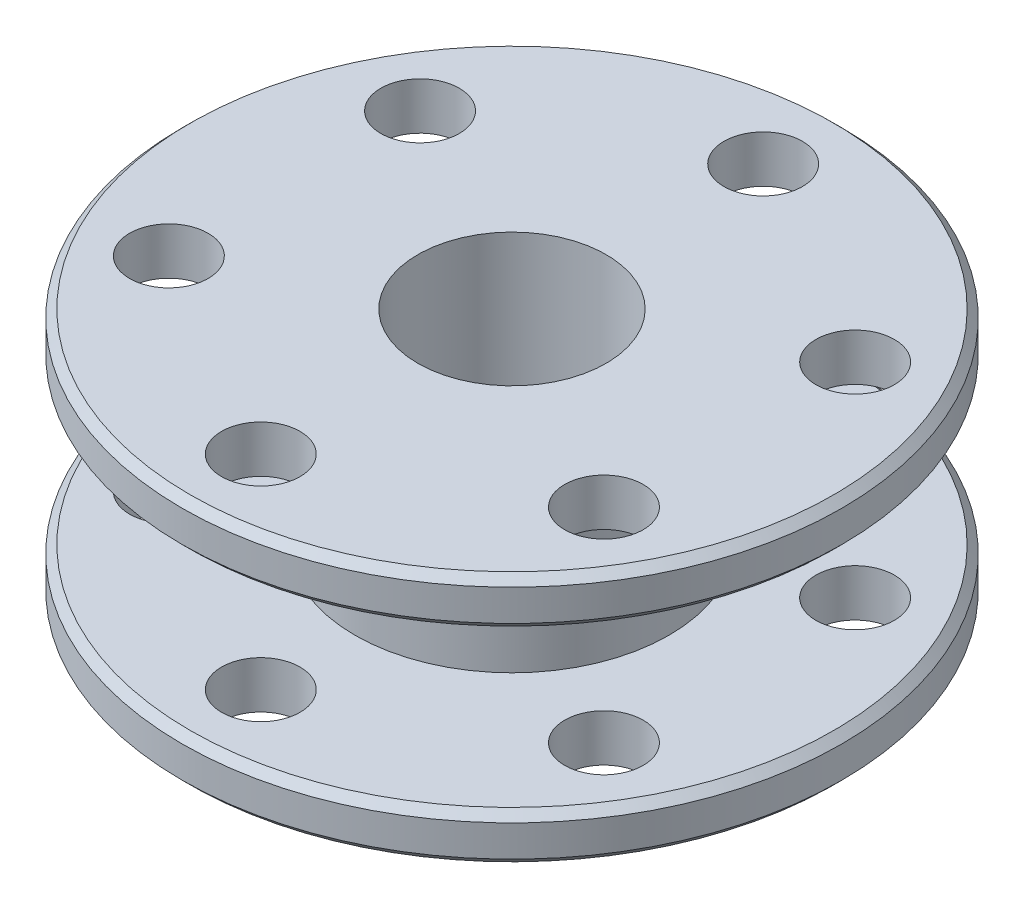
ISO-10303-21;
HEADER;
FILE_DESCRIPTION(('STEP AP214'),'2;1');
FILE_NAME('part.step','',(''),(''),'','','');
FILE_SCHEMA(('AUTOMOTIVE_DESIGN { 1 0 10303 214 1 1 1 1 }'));
ENDSEC;
DATA;
#1=APPLICATION_CONTEXT('core data for automotive mechanical design processes');
#2=APPLICATION_PROTOCOL_DEFINITION('international standard','automotive_design',2000,#1);
#3=PRODUCT_CONTEXT('',#1,'mechanical');
#4=PRODUCT('Part','Part','',(#3));
#5=PRODUCT_RELATED_PRODUCT_CATEGORY('part','',(#4));
#6=PRODUCT_DEFINITION_FORMATION('','',#4);
#7=PRODUCT_DEFINITION_CONTEXT('part definition',#1,'design');
#8=PRODUCT_DEFINITION('design','',#6,#7);
#9=PRODUCT_DEFINITION_SHAPE('','',#8);
#10=(LENGTH_UNIT() NAMED_UNIT(*) SI_UNIT(.MILLI.,.METRE.));
#11=(NAMED_UNIT(*) PLANE_ANGLE_UNIT() SI_UNIT($,.RADIAN.));
#12=(NAMED_UNIT(*) SI_UNIT($,.STERADIAN.) SOLID_ANGLE_UNIT());
#13=UNCERTAINTY_MEASURE_WITH_UNIT(LENGTH_MEASURE(1.E-05),#10,'distance_accuracy_value','');
#14=(GEOMETRIC_REPRESENTATION_CONTEXT(3) GLOBAL_UNCERTAINTY_ASSIGNED_CONTEXT((#13)) GLOBAL_UNIT_ASSIGNED_CONTEXT((#10,
#11,#12)) REPRESENTATION_CONTEXT('',''));
#15=CARTESIAN_POINT('',(0.,0.,0.));
#16=DIRECTION('',(0.,0.,1.));
#17=DIRECTION('',(1.,0.,0.));
#18=AXIS2_PLACEMENT_3D('',#15,#16,#17);
#19=CARTESIAN_POINT('',(-6.,-8.,0.));
#20=DIRECTION('',(0.,-1.,0.));
#21=DIRECTION('',(0.,0.,-1.));
#22=AXIS2_PLACEMENT_3D('',#19,#20,#21);
#23=PLANE('',#22);
#24=CARTESIAN_POINT('',(0.,-8.,16.));
#25=DIRECTION('',(0.,-1.,0.));
#26=DIRECTION('',(0.,0.,-1.));
#27=AXIS2_PLACEMENT_3D('',#24,#25,#26);
#28=CIRCLE('',#27,2.5);
#29=CARTESIAN_POINT('',(0.,-8.,13.5));
#30=VERTEX_POINT('',#29);
#31=EDGE_CURVE('E180',#30,#30,#28,.T.);
#32=ORIENTED_EDGE('',*,*,#31,.F.);
#33=EDGE_LOOP('',(#32));
#34=FACE_BOUND('',#33,.T.);
#35=CARTESIAN_POINT('',(-13.8564064605509,-8.,8.00000000000016));
#36=DIRECTION('',(0.,-1.,0.));
#37=DIRECTION('',(0.,0.,-1.));
#38=AXIS2_PLACEMENT_3D('',#35,#36,#37);
#39=CIRCLE('',#38,2.5);
#40=CARTESIAN_POINT('',(-13.8564064605509,-8.,5.50000000000016));
#41=VERTEX_POINT('',#40);
#42=EDGE_CURVE('E181',#41,#41,#39,.T.);
#43=ORIENTED_EDGE('',*,*,#42,.F.);
#44=EDGE_LOOP('',(#43));
#45=FACE_BOUND('',#44,.T.);
#46=CARTESIAN_POINT('',(-13.8564064605511,-8.,-7.99999999999987));
#47=DIRECTION('',(0.,-1.,0.));
#48=DIRECTION('',(0.,0.,-1.));
#49=AXIS2_PLACEMENT_3D('',#46,#47,#48);
#50=CIRCLE('',#49,2.5);
#51=CARTESIAN_POINT('',(-13.8564064605511,-8.,-10.4999999999999));
#52=VERTEX_POINT('',#51);
#53=EDGE_CURVE('E147',#52,#52,#50,.T.);
#54=ORIENTED_EDGE('',*,*,#53,.F.);
#55=EDGE_LOOP('',(#54));
#56=FACE_BOUND('',#55,.T.);
#57=CARTESIAN_POINT('',(-1.1172740284298E-13,-8.,-16.));
#58=DIRECTION('',(0.,-1.,0.));
#59=DIRECTION('',(0.,0.,-1.));
#60=AXIS2_PLACEMENT_3D('',#57,#58,#59);
#61=CIRCLE('',#60,2.5);
#62=CARTESIAN_POINT('',(-1.1172740284298E-13,-8.,-18.5));
#63=VERTEX_POINT('',#62);
#64=EDGE_CURVE('E156',#63,#63,#61,.T.);
#65=ORIENTED_EDGE('',*,*,#64,.F.);
#66=EDGE_LOOP('',(#65));
#67=FACE_BOUND('',#66,.T.);
#68=CARTESIAN_POINT('',(13.856406460551,-8.,-8.00000000000007));
#69=DIRECTION('',(0.,-1.,0.));
#70=DIRECTION('',(0.,0.,-1.));
#71=AXIS2_PLACEMENT_3D('',#68,#69,#70);
#72=CIRCLE('',#71,2.5);
#73=CARTESIAN_POINT('',(13.856406460551,-8.,-10.5000000000001));
#74=VERTEX_POINT('',#73);
#75=EDGE_CURVE('E164',#74,#74,#72,.T.);
#76=ORIENTED_EDGE('',*,*,#75,.F.);
#77=EDGE_LOOP('',(#76));
#78=FACE_BOUND('',#77,.T.);
#79=CARTESIAN_POINT('',(13.856406460551,-8.,7.99999999999997));
#80=DIRECTION('',(0.,-1.,0.));
#81=DIRECTION('',(0.,0.,-1.));
#82=AXIS2_PLACEMENT_3D('',#79,#80,#81);
#83=CIRCLE('',#82,2.5);
#84=CARTESIAN_POINT('',(13.856406460551,-8.,5.49999999999997));
#85=VERTEX_POINT('',#84);
#86=EDGE_CURVE('E172',#85,#85,#83,.T.);
#87=ORIENTED_EDGE('',*,*,#86,.F.);
#88=EDGE_LOOP('',(#87));
#89=FACE_BOUND('',#88,.T.);
#90=CARTESIAN_POINT('',(0.,-8.,0.));
#91=DIRECTION('',(0.,-1.,0.));
#92=DIRECTION('',(0.,0.,-1.));
#93=AXIS2_PLACEMENT_3D('',#90,#91,#92);
#94=CIRCLE('',#93,20.5);
#95=CARTESIAN_POINT('',(0.,-8.,-20.5));
#96=VERTEX_POINT('',#95);
#97=EDGE_CURVE('E70',#96,#96,#94,.T.);
#98=ORIENTED_EDGE('',*,*,#97,.T.);
#99=EDGE_LOOP('',(#98));
#100=FACE_BOUND('',#99,.T.);
#101=CARTESIAN_POINT('',(0.,-8.,0.));
#102=DIRECTION('',(0.,1.,0.));
#103=DIRECTION('',(0.,0.,1.));
#104=AXIS2_PLACEMENT_3D('',#101,#102,#103);
#105=CIRCLE('',#104,6.);
#106=CARTESIAN_POINT('',(0.,-8.,6.));
#107=VERTEX_POINT('',#106);
#108=EDGE_CURVE('E94',#107,#107,#105,.T.);
#109=ORIENTED_EDGE('',*,*,#108,.T.);
#110=EDGE_LOOP('',(#109));
#111=FACE_BOUND('',#110,.T.);
#112=ADVANCED_FACE('F41',(#34,#45,#56,#67,#78,#89,#100,#111),#23,.T.);
#113=CARTESIAN_POINT('',(0.,39.6851391119242,0.));
#114=DIRECTION('',(0.,1.,0.));
#115=DIRECTION('',(0.,0.,1.));
#116=AXIS2_PLACEMENT_3D('',#113,#114,#115);
#117=CYLINDRICAL_SURFACE('',#116,21.);
#118=CARTESIAN_POINT('',(0.,-7.50000000000001,0.));
#119=DIRECTION('',(0.,-1.,0.));
#120=DIRECTION('',(0.,0.,-1.));
#121=AXIS2_PLACEMENT_3D('',#118,#119,#120);
#122=CIRCLE('',#121,21.);
#123=CARTESIAN_POINT('',(0.,-7.50000000000001,-21.));
#124=VERTEX_POINT('',#123);
#125=EDGE_CURVE('E74',#124,#124,#122,.F.);
#126=ORIENTED_EDGE('',*,*,#125,.T.);
#127=EDGE_LOOP('',(#126));
#128=FACE_BOUND('',#127,.T.);
#129=CARTESIAN_POINT('',(0.,-5.50000000000001,0.));
#130=DIRECTION('',(0.,1.,0.));
#131=DIRECTION('',(0.,0.,1.));
#132=AXIS2_PLACEMENT_3D('',#129,#130,#131);
#133=CIRCLE('',#132,21.);
#134=CARTESIAN_POINT('',(0.,-5.50000000000001,21.));
#135=VERTEX_POINT('',#134);
#136=EDGE_CURVE('E78',#135,#135,#133,.F.);
#137=ORIENTED_EDGE('',*,*,#136,.T.);
#138=EDGE_LOOP('',(#137));
#139=FACE_BOUND('',#138,.T.);
#140=ADVANCED_FACE('F220',(#128,#139),#117,.T.);
#141=CARTESIAN_POINT('',(-21.,-5.00000000000001,0.));
#142=DIRECTION('',(0.,1.,0.));
#143=DIRECTION('',(0.,0.,1.));
#144=AXIS2_PLACEMENT_3D('',#141,#142,#143);
#145=PLANE('',#144);
#146=CARTESIAN_POINT('',(0.,-5.00000000000001,16.));
#147=DIRECTION('',(0.,1.,0.));
#148=DIRECTION('',(0.,0.,1.));
#149=AXIS2_PLACEMENT_3D('',#146,#147,#148);
#150=CIRCLE('',#149,2.5);
#151=CARTESIAN_POINT('',(0.,-5.00000000000001,18.5));
#152=VERTEX_POINT('',#151);
#153=EDGE_CURVE('E98',#152,#152,#150,.T.);
#154=ORIENTED_EDGE('',*,*,#153,.F.);
#155=EDGE_LOOP('',(#154));
#156=FACE_BOUND('',#155,.T.);
#157=CARTESIAN_POINT('',(-13.8564064605509,-5.00000000000001,8.00000000000016));
#158=DIRECTION('',(0.,1.,0.));
#159=DIRECTION('',(0.,0.,1.));
#160=AXIS2_PLACEMENT_3D('',#157,#158,#159);
#161=CIRCLE('',#160,2.5);
#162=CARTESIAN_POINT('',(-13.8564064605509,-5.00000000000001,10.5000000000002));
#163=VERTEX_POINT('',#162);
#164=EDGE_CURVE('E106',#163,#163,#161,.T.);
#165=ORIENTED_EDGE('',*,*,#164,.F.);
#166=EDGE_LOOP('',(#165));
#167=FACE_BOUND('',#166,.T.);
#168=CARTESIAN_POINT('',(-13.8564064605511,-5.00000000000001,-7.99999999999987));
#169=DIRECTION('',(0.,1.,0.));
#170=DIRECTION('',(0.,0.,1.));
#171=AXIS2_PLACEMENT_3D('',#168,#169,#170);
#172=CIRCLE('',#171,2.5);
#173=CARTESIAN_POINT('',(-13.8564064605511,-5.00000000000001,-5.49999999999987));
#174=VERTEX_POINT('',#173);
#175=EDGE_CURVE('E114',#174,#174,#172,.T.);
#176=ORIENTED_EDGE('',*,*,#175,.F.);
#177=EDGE_LOOP('',(#176));
#178=FACE_BOUND('',#177,.T.);
#179=CARTESIAN_POINT('',(-1.1172740284298E-13,-5.00000000000001,-16.));
#180=DIRECTION('',(0.,1.,0.));
#181=DIRECTION('',(0.,0.,1.));
#182=AXIS2_PLACEMENT_3D('',#179,#180,#181);
#183=CIRCLE('',#182,2.5);
#184=CARTESIAN_POINT('',(-1.1172740284298E-13,-5.00000000000001,-13.5));
#185=VERTEX_POINT('',#184);
#186=EDGE_CURVE('E122',#185,#185,#183,.T.);
#187=ORIENTED_EDGE('',*,*,#186,.F.);
#188=EDGE_LOOP('',(#187));
#189=FACE_BOUND('',#188,.T.);
#190=CARTESIAN_POINT('',(13.856406460551,-5.00000000000001,-8.00000000000007));
#191=DIRECTION('',(0.,1.,0.));
#192=DIRECTION('',(0.,0.,1.));
#193=AXIS2_PLACEMENT_3D('',#190,#191,#192);
#194=CIRCLE('',#193,2.5);
#195=CARTESIAN_POINT('',(13.856406460551,-5.00000000000001,-5.50000000000006));
#196=VERTEX_POINT('',#195);
#197=EDGE_CURVE('E130',#196,#196,#194,.T.);
#198=ORIENTED_EDGE('',*,*,#197,.F.);
#199=EDGE_LOOP('',(#198));
#200=FACE_BOUND('',#199,.T.);
#201=CARTESIAN_POINT('',(13.856406460551,-5.00000000000001,7.99999999999997));
#202=DIRECTION('',(0.,1.,0.));
#203=DIRECTION('',(0.,0.,1.));
#204=AXIS2_PLACEMENT_3D('',#201,#202,#203);
#205=CIRCLE('',#204,2.5);
#206=CARTESIAN_POINT('',(13.856406460551,-5.00000000000001,10.5));
#207=VERTEX_POINT('',#206);
#208=EDGE_CURVE('E138',#207,#207,#205,.T.);
#209=ORIENTED_EDGE('',*,*,#208,.F.);
#210=EDGE_LOOP('',(#209));
#211=FACE_BOUND('',#210,.T.);
#212=CARTESIAN_POINT('',(0.,-5.00000000000001,0.));
#213=DIRECTION('',(0.,1.,0.));
#214=DIRECTION('',(0.,0.,1.));
#215=AXIS2_PLACEMENT_3D('',#212,#213,#214);
#216=CIRCLE('',#215,20.5);
#217=CARTESIAN_POINT('',(0.,-5.00000000000001,20.5));
#218=VERTEX_POINT('',#217);
#219=EDGE_CURVE('E66',#218,#218,#216,.T.);
#220=ORIENTED_EDGE('',*,*,#219,.T.);
#221=EDGE_LOOP('',(#220));
#222=FACE_BOUND('',#221,.T.);
#223=CARTESIAN_POINT('',(0.,-5.00000000000001,0.));
#224=DIRECTION('',(0.,1.,0.));
#225=DIRECTION('',(0.,0.,1.));
#226=AXIS2_PLACEMENT_3D('',#223,#224,#225);
#227=CIRCLE('',#226,10.);
#228=CARTESIAN_POINT('',(0.,-5.00000000000001,10.));
#229=VERTEX_POINT('',#228);
#230=EDGE_CURVE('E82',#229,#229,#227,.T.);
#231=ORIENTED_EDGE('',*,*,#230,.F.);
#232=EDGE_LOOP('',(#231));
#233=FACE_BOUND('',#232,.T.);
#234=ADVANCED_FACE('F226',(#156,#167,#178,#189,#200,#211,#222,#233),#145,.T.);
#235=CARTESIAN_POINT('',(0.,39.6851391119242,0.));
#236=DIRECTION('',(0.,1.,0.));
#237=DIRECTION('',(0.,0.,1.));
#238=AXIS2_PLACEMENT_3D('',#235,#236,#237);
#239=CYLINDRICAL_SURFACE('',#238,10.);
#240=ORIENTED_EDGE('',*,*,#230,.T.);
#241=EDGE_LOOP('',(#240));
#242=FACE_BOUND('',#241,.T.);
#243=CARTESIAN_POINT('',(0.,5.00000000000001,0.));
#244=DIRECTION('',(0.,1.,0.));
#245=DIRECTION('',(0.,0.,1.));
#246=AXIS2_PLACEMENT_3D('',#243,#244,#245);
#247=CIRCLE('',#246,10.);
#248=CARTESIAN_POINT('',(0.,5.00000000000001,10.));
#249=VERTEX_POINT('',#248);
#250=EDGE_CURVE('E86',#249,#249,#247,.T.);
#251=ORIENTED_EDGE('',*,*,#250,.F.);
#252=EDGE_LOOP('',(#251));
#253=FACE_BOUND('',#252,.T.);
#254=ADVANCED_FACE('F272',(#242,#253),#239,.T.);
#255=CARTESIAN_POINT('',(-10.,5.00000000000001,0.));
#256=DIRECTION('',(0.,-1.,0.));
#257=DIRECTION('',(0.,0.,-1.));
#258=AXIS2_PLACEMENT_3D('',#255,#256,#257);
#259=PLANE('',#258);
#260=CARTESIAN_POINT('',(0.,5.00000000000001,16.));
#261=DIRECTION('',(0.,-1.,0.));
#262=DIRECTION('',(0.,0.,-1.));
#263=AXIS2_PLACEMENT_3D('',#260,#261,#262);
#264=CIRCLE('',#263,2.5);
#265=CARTESIAN_POINT('',(0.,5.00000000000001,13.5));
#266=VERTEX_POINT('',#265);
#267=EDGE_CURVE('E102',#266,#266,#264,.T.);
#268=ORIENTED_EDGE('',*,*,#267,.F.);
#269=EDGE_LOOP('',(#268));
#270=FACE_BOUND('',#269,.T.);
#271=CARTESIAN_POINT('',(-13.8564064605509,5.00000000000001,8.00000000000016));
#272=DIRECTION('',(0.,-1.,0.));
#273=DIRECTION('',(0.,0.,-1.));
#274=AXIS2_PLACEMENT_3D('',#271,#272,#273);
#275=CIRCLE('',#274,2.5);
#276=CARTESIAN_POINT('',(-13.8564064605509,5.00000000000001,5.50000000000016));
#277=VERTEX_POINT('',#276);
#278=EDGE_CURVE('E110',#277,#277,#275,.T.);
#279=ORIENTED_EDGE('',*,*,#278,.F.);
#280=EDGE_LOOP('',(#279));
#281=FACE_BOUND('',#280,.T.);
#282=CARTESIAN_POINT('',(-13.8564064605511,5.00000000000001,-7.99999999999987));
#283=DIRECTION('',(0.,-1.,0.));
#284=DIRECTION('',(0.,0.,-1.));
#285=AXIS2_PLACEMENT_3D('',#282,#283,#284);
#286=CIRCLE('',#285,2.5);
#287=CARTESIAN_POINT('',(-13.8564064605511,5.00000000000001,-10.4999999999999));
#288=VERTEX_POINT('',#287);
#289=EDGE_CURVE('E118',#288,#288,#286,.T.);
#290=ORIENTED_EDGE('',*,*,#289,.F.);
#291=EDGE_LOOP('',(#290));
#292=FACE_BOUND('',#291,.T.);
#293=CARTESIAN_POINT('',(-1.1172740284298E-13,5.00000000000001,-16.));
#294=DIRECTION('',(0.,-1.,0.));
#295=DIRECTION('',(0.,0.,-1.));
#296=AXIS2_PLACEMENT_3D('',#293,#294,#295);
#297=CIRCLE('',#296,2.5);
#298=CARTESIAN_POINT('',(-1.1172740284298E-13,5.00000000000001,-18.5));
#299=VERTEX_POINT('',#298);
#300=EDGE_CURVE('E126',#299,#299,#297,.T.);
#301=ORIENTED_EDGE('',*,*,#300,.F.);
#302=EDGE_LOOP('',(#301));
#303=FACE_BOUND('',#302,.T.);
#304=CARTESIAN_POINT('',(13.856406460551,5.00000000000001,-8.00000000000007));
#305=DIRECTION('',(0.,-1.,0.));
#306=DIRECTION('',(0.,0.,-1.));
#307=AXIS2_PLACEMENT_3D('',#304,#305,#306);
#308=CIRCLE('',#307,2.5);
#309=CARTESIAN_POINT('',(13.856406460551,5.00000000000001,-10.5000000000001));
#310=VERTEX_POINT('',#309);
#311=EDGE_CURVE('E134',#310,#310,#308,.T.);
#312=ORIENTED_EDGE('',*,*,#311,.F.);
#313=EDGE_LOOP('',(#312));
#314=FACE_BOUND('',#313,.T.);
#315=CARTESIAN_POINT('',(13.856406460551,5.00000000000001,7.99999999999997));
#316=DIRECTION('',(0.,-1.,0.));
#317=DIRECTION('',(0.,0.,-1.));
#318=AXIS2_PLACEMENT_3D('',#315,#316,#317);
#319=CIRCLE('',#318,2.5);
#320=CARTESIAN_POINT('',(13.856406460551,5.00000000000001,5.49999999999997));
#321=VERTEX_POINT('',#320);
#322=EDGE_CURVE('E142',#321,#321,#319,.T.);
#323=ORIENTED_EDGE('',*,*,#322,.F.);
#324=EDGE_LOOP('',(#323));
#325=FACE_BOUND('',#324,.T.);
#326=CARTESIAN_POINT('',(0.,5.00000000000001,0.));
#327=DIRECTION('',(0.,-1.,0.));
#328=DIRECTION('',(0.,0.,-1.));
#329=AXIS2_PLACEMENT_3D('',#326,#327,#328);
#330=CIRCLE('',#329,20.5);
#331=CARTESIAN_POINT('',(0.,5.00000000000001,-20.5));
#332=VERTEX_POINT('',#331);
#333=EDGE_CURVE('E50',#332,#332,#330,.T.);
#334=ORIENTED_EDGE('',*,*,#333,.T.);
#335=EDGE_LOOP('',(#334));
#336=FACE_BOUND('',#335,.T.);
#337=ORIENTED_EDGE('',*,*,#250,.T.);
#338=EDGE_LOOP('',(#337));
#339=FACE_BOUND('',#338,.T.);
#340=ADVANCED_FACE('F263',(#270,#281,#292,#303,#314,#325,#336,#339),#259,.T.);
#341=CARTESIAN_POINT('',(0.,39.6851391119242,0.));
#342=DIRECTION('',(0.,1.,0.));
#343=DIRECTION('',(0.,0.,1.));
#344=AXIS2_PLACEMENT_3D('',#341,#342,#343);
#345=CYLINDRICAL_SURFACE('',#344,21.);
#346=CARTESIAN_POINT('',(0.,5.50000000000001,0.));
#347=DIRECTION('',(0.,-1.,0.));
#348=DIRECTION('',(0.,0.,-1.));
#349=AXIS2_PLACEMENT_3D('',#346,#347,#348);
#350=CIRCLE('',#349,21.);
#351=CARTESIAN_POINT('',(0.,5.50000000000001,-21.));
#352=VERTEX_POINT('',#351);
#353=EDGE_CURVE('E55',#352,#352,#350,.F.);
#354=ORIENTED_EDGE('',*,*,#353,.T.);
#355=EDGE_LOOP('',(#354));
#356=FACE_BOUND('',#355,.T.);
#357=CARTESIAN_POINT('',(0.,7.50000000000001,0.));
#358=DIRECTION('',(0.,1.,0.));
#359=DIRECTION('',(0.,0.,1.));
#360=AXIS2_PLACEMENT_3D('',#357,#358,#359);
#361=CIRCLE('',#360,21.);
#362=CARTESIAN_POINT('',(0.,7.50000000000001,21.));
#363=VERTEX_POINT('',#362);
#364=EDGE_CURVE('E60',#363,#363,#361,.F.);
#365=ORIENTED_EDGE('',*,*,#364,.T.);
#366=EDGE_LOOP('',(#365));
#367=FACE_BOUND('',#366,.T.);
#368=ADVANCED_FACE('F260',(#356,#367),#345,.T.);
#369=CARTESIAN_POINT('',(-21.,8.,0.));
#370=DIRECTION('',(0.,1.,0.));
#371=DIRECTION('',(0.,0.,1.));
#372=AXIS2_PLACEMENT_3D('',#369,#370,#371);
#373=PLANE('',#372);
#374=CARTESIAN_POINT('',(0.,8.,16.));
#375=DIRECTION('',(0.,-1.,0.));
#376=DIRECTION('',(0.,0.,-1.));
#377=AXIS2_PLACEMENT_3D('',#374,#375,#376);
#378=CIRCLE('',#377,2.5);
#379=CARTESIAN_POINT('',(0.,8.,13.5));
#380=VERTEX_POINT('',#379);
#381=EDGE_CURVE('E146',#380,#380,#378,.T.);
#382=ORIENTED_EDGE('',*,*,#381,.T.);
#383=EDGE_LOOP('',(#382));
#384=FACE_BOUND('',#383,.T.);
#385=CARTESIAN_POINT('',(-13.8564064605509,8.,8.00000000000016));
#386=DIRECTION('',(0.,-1.,0.));
#387=DIRECTION('',(0.,0.,-1.));
#388=AXIS2_PLACEMENT_3D('',#385,#386,#387);
#389=CIRCLE('',#388,2.5);
#390=CARTESIAN_POINT('',(-13.8564064605509,8.,5.50000000000016));
#391=VERTEX_POINT('',#390);
#392=EDGE_CURVE('E152',#391,#391,#389,.T.);
#393=ORIENTED_EDGE('',*,*,#392,.T.);
#394=EDGE_LOOP('',(#393));
#395=FACE_BOUND('',#394,.T.);
#396=CARTESIAN_POINT('',(-13.8564064605511,8.,-7.99999999999987));
#397=DIRECTION('',(0.,-1.,0.));
#398=DIRECTION('',(0.,0.,-1.));
#399=AXIS2_PLACEMENT_3D('',#396,#397,#398);
#400=CIRCLE('',#399,2.5);
#401=CARTESIAN_POINT('',(-13.8564064605511,8.,-10.4999999999999));
#402=VERTEX_POINT('',#401);
#403=EDGE_CURVE('E151',#402,#402,#400,.T.);
#404=ORIENTED_EDGE('',*,*,#403,.T.);
#405=EDGE_LOOP('',(#404));
#406=FACE_BOUND('',#405,.T.);
#407=CARTESIAN_POINT('',(-1.1172740284298E-13,8.,-16.));
#408=DIRECTION('',(0.,-1.,0.));
#409=DIRECTION('',(0.,0.,-1.));
#410=AXIS2_PLACEMENT_3D('',#407,#408,#409);
#411=CIRCLE('',#410,2.5);
#412=CARTESIAN_POINT('',(-1.1172740284298E-13,8.,-18.5));
#413=VERTEX_POINT('',#412);
#414=EDGE_CURVE('E160',#413,#413,#411,.T.);
#415=ORIENTED_EDGE('',*,*,#414,.T.);
#416=EDGE_LOOP('',(#415));
#417=FACE_BOUND('',#416,.T.);
#418=CARTESIAN_POINT('',(13.856406460551,8.,-8.00000000000007));
#419=DIRECTION('',(0.,-1.,0.));
#420=DIRECTION('',(0.,0.,-1.));
#421=AXIS2_PLACEMENT_3D('',#418,#419,#420);
#422=CIRCLE('',#421,2.5);
#423=CARTESIAN_POINT('',(13.856406460551,8.,-10.5000000000001));
#424=VERTEX_POINT('',#423);
#425=EDGE_CURVE('E168',#424,#424,#422,.T.);
#426=ORIENTED_EDGE('',*,*,#425,.T.);
#427=EDGE_LOOP('',(#426));
#428=FACE_BOUND('',#427,.T.);
#429=CARTESIAN_POINT('',(13.856406460551,8.,7.99999999999997));
#430=DIRECTION('',(0.,-1.,0.));
#431=DIRECTION('',(0.,0.,-1.));
#432=AXIS2_PLACEMENT_3D('',#429,#430,#431);
#433=CIRCLE('',#432,2.5);
#434=CARTESIAN_POINT('',(13.856406460551,8.,5.49999999999997));
#435=VERTEX_POINT('',#434);
#436=EDGE_CURVE('E176',#435,#435,#433,.T.);
#437=ORIENTED_EDGE('',*,*,#436,.T.);
#438=EDGE_LOOP('',(#437));
#439=FACE_BOUND('',#438,.T.);
#440=CARTESIAN_POINT('',(0.,8.,0.));
#441=DIRECTION('',(0.,1.,0.));
#442=DIRECTION('',(0.,0.,1.));
#443=AXIS2_PLACEMENT_3D('',#440,#441,#442);
#444=CIRCLE('',#443,20.5);
#445=CARTESIAN_POINT('',(0.,8.,20.5));
#446=VERTEX_POINT('',#445);
#447=EDGE_CURVE('E10',#446,#446,#444,.T.);
#448=ORIENTED_EDGE('',*,*,#447,.T.);
#449=EDGE_LOOP('',(#448));
#450=FACE_BOUND('',#449,.T.);
#451=CARTESIAN_POINT('',(0.,8.,0.));
#452=DIRECTION('',(0.,1.,0.));
#453=DIRECTION('',(0.,0.,1.));
#454=AXIS2_PLACEMENT_3D('',#451,#452,#453);
#455=CIRCLE('',#454,6.00000000000001);
#456=CARTESIAN_POINT('',(0.,8.,6.00000000000001));
#457=VERTEX_POINT('',#456);
#458=EDGE_CURVE('E90',#457,#457,#455,.T.);
#459=ORIENTED_EDGE('',*,*,#458,.F.);
#460=EDGE_LOOP('',(#459));
#461=FACE_BOUND('',#460,.T.);
#462=ADVANCED_FACE('F195',(#384,#395,#406,#417,#428,#439,#450,#461),#373,.T.);
#463=CARTESIAN_POINT('',(0.,39.6851391119242,0.));
#464=DIRECTION('',(0.,1.,0.));
#465=DIRECTION('',(0.,0.,1.));
#466=AXIS2_PLACEMENT_3D('',#463,#464,#465);
#467=CYLINDRICAL_SURFACE('',#466,6.);
#468=ORIENTED_EDGE('',*,*,#458,.T.);
#469=EDGE_LOOP('',(#468));
#470=FACE_BOUND('',#469,.T.);
#471=ORIENTED_EDGE('',*,*,#108,.F.);
#472=EDGE_LOOP('',(#471));
#473=FACE_BOUND('',#472,.T.);
#474=ADVANCED_FACE('F241',(#470,#473),#467,.F.);
#475=CARTESIAN_POINT('',(0.,-7.50000000000001,0.));
#476=DIRECTION('',(0.,1.,0.));
#477=DIRECTION('',(0.,0.,1.));
#478=AXIS2_PLACEMENT_3D('',#475,#476,#477);
#479=CONICAL_SURFACE('',#478,21.,0.785398163397445);
#480=ORIENTED_EDGE('',*,*,#97,.F.);
#481=EDGE_LOOP('',(#480));
#482=FACE_BOUND('',#481,.T.);
#483=ORIENTED_EDGE('',*,*,#125,.F.);
#484=EDGE_LOOP('',(#483));
#485=FACE_BOUND('',#484,.T.);
#486=ADVANCED_FACE('F234',(#482,#485),#479,.T.);
#487=CARTESIAN_POINT('',(0.,-5.00000000000001,0.));
#488=DIRECTION('',(0.,-1.,0.));
#489=DIRECTION('',(0.,0.,-1.));
#490=AXIS2_PLACEMENT_3D('',#487,#488,#489);
#491=CONICAL_SURFACE('',#490,20.5,0.785398163397448);
#492=ORIENTED_EDGE('',*,*,#136,.F.);
#493=EDGE_LOOP('',(#492));
#494=FACE_BOUND('',#493,.T.);
#495=ORIENTED_EDGE('',*,*,#219,.F.);
#496=EDGE_LOOP('',(#495));
#497=FACE_BOUND('',#496,.T.);
#498=ADVANCED_FACE('F240',(#494,#497),#491,.T.);
#499=CARTESIAN_POINT('',(0.,5.50000000000001,0.));
#500=DIRECTION('',(0.,1.,0.));
#501=DIRECTION('',(0.,0.,1.));
#502=AXIS2_PLACEMENT_3D('',#499,#500,#501);
#503=CONICAL_SURFACE('',#502,21.,0.785398163397452);
#504=ORIENTED_EDGE('',*,*,#333,.F.);
#505=EDGE_LOOP('',(#504));
#506=FACE_BOUND('',#505,.T.);
#507=ORIENTED_EDGE('',*,*,#353,.F.);
#508=EDGE_LOOP('',(#507));
#509=FACE_BOUND('',#508,.T.);
#510=ADVANCED_FACE('F247',(#506,#509),#503,.T.);
#511=CARTESIAN_POINT('',(0.,8.,0.));
#512=DIRECTION('',(0.,-1.,0.));
#513=DIRECTION('',(0.,0.,-1.));
#514=AXIS2_PLACEMENT_3D('',#511,#512,#513);
#515=CONICAL_SURFACE('',#514,20.5,0.785398163397441);
#516=ORIENTED_EDGE('',*,*,#364,.F.);
#517=EDGE_LOOP('',(#516));
#518=FACE_BOUND('',#517,.T.);
#519=ORIENTED_EDGE('',*,*,#447,.F.);
#520=EDGE_LOOP('',(#519));
#521=FACE_BOUND('',#520,.T.);
#522=ADVANCED_FACE('F44',(#518,#521),#515,.T.);
#523=CARTESIAN_POINT('',(13.856406460551,8.,7.99999999999997));
#524=DIRECTION('',(0.,-1.,0.));
#525=DIRECTION('',(0.,0.,-1.));
#526=AXIS2_PLACEMENT_3D('',#523,#524,#525);
#527=CYLINDRICAL_SURFACE('',#526,2.5);
#528=ORIENTED_EDGE('',*,*,#322,.T.);
#529=EDGE_LOOP('',(#528));
#530=FACE_BOUND('',#529,.T.);
#531=ORIENTED_EDGE('',*,*,#436,.F.);
#532=EDGE_LOOP('',(#531));
#533=FACE_BOUND('',#532,.T.);
#534=ADVANCED_FACE('F212',(#530,#533),#527,.F.);
#535=CARTESIAN_POINT('',(13.856406460551,8.,-8.00000000000007));
#536=DIRECTION('',(0.,-1.,0.));
#537=DIRECTION('',(0.,0.,-1.));
#538=AXIS2_PLACEMENT_3D('',#535,#536,#537);
#539=CYLINDRICAL_SURFACE('',#538,2.5);
#540=ORIENTED_EDGE('',*,*,#311,.T.);
#541=EDGE_LOOP('',(#540));
#542=FACE_BOUND('',#541,.T.);
#543=ORIENTED_EDGE('',*,*,#425,.F.);
#544=EDGE_LOOP('',(#543));
#545=FACE_BOUND('',#544,.T.);
#546=ADVANCED_FACE('F322',(#542,#545),#539,.F.);
#547=CARTESIAN_POINT('',(-1.1172740284298E-13,8.,-16.));
#548=DIRECTION('',(0.,-1.,0.));
#549=DIRECTION('',(0.,0.,-1.));
#550=AXIS2_PLACEMENT_3D('',#547,#548,#549);
#551=CYLINDRICAL_SURFACE('',#550,2.5);
#552=ORIENTED_EDGE('',*,*,#300,.T.);
#553=EDGE_LOOP('',(#552));
#554=FACE_BOUND('',#553,.T.);
#555=ORIENTED_EDGE('',*,*,#414,.F.);
#556=EDGE_LOOP('',(#555));
#557=FACE_BOUND('',#556,.T.);
#558=ADVANCED_FACE('F317',(#554,#557),#551,.F.);
#559=CARTESIAN_POINT('',(-13.8564064605511,8.,-7.99999999999987));
#560=DIRECTION('',(0.,-1.,0.));
#561=DIRECTION('',(0.,0.,-1.));
#562=AXIS2_PLACEMENT_3D('',#559,#560,#561);
#563=CYLINDRICAL_SURFACE('',#562,2.5);
#564=ORIENTED_EDGE('',*,*,#289,.T.);
#565=EDGE_LOOP('',(#564));
#566=FACE_BOUND('',#565,.T.);
#567=ORIENTED_EDGE('',*,*,#403,.F.);
#568=EDGE_LOOP('',(#567));
#569=FACE_BOUND('',#568,.T.);
#570=ADVANCED_FACE('F213',(#566,#569),#563,.F.);
#571=CARTESIAN_POINT('',(-13.8564064605509,8.,8.00000000000016));
#572=DIRECTION('',(0.,-1.,0.));
#573=DIRECTION('',(0.,0.,-1.));
#574=AXIS2_PLACEMENT_3D('',#571,#572,#573);
#575=CYLINDRICAL_SURFACE('',#574,2.5);
#576=ORIENTED_EDGE('',*,*,#278,.T.);
#577=EDGE_LOOP('',(#576));
#578=FACE_BOUND('',#577,.T.);
#579=ORIENTED_EDGE('',*,*,#392,.F.);
#580=EDGE_LOOP('',(#579));
#581=FACE_BOUND('',#580,.T.);
#582=ADVANCED_FACE('F201',(#578,#581),#575,.F.);
#583=CARTESIAN_POINT('',(0.,8.,16.));
#584=DIRECTION('',(0.,-1.,0.));
#585=DIRECTION('',(0.,0.,-1.));
#586=AXIS2_PLACEMENT_3D('',#583,#584,#585);
#587=CYLINDRICAL_SURFACE('',#586,2.5);
#588=ORIENTED_EDGE('',*,*,#267,.T.);
#589=EDGE_LOOP('',(#588));
#590=FACE_BOUND('',#589,.T.);
#591=ORIENTED_EDGE('',*,*,#381,.F.);
#592=EDGE_LOOP('',(#591));
#593=FACE_BOUND('',#592,.T.);
#594=ADVANCED_FACE('F198',(#590,#593),#587,.F.);
#595=ORIENTED_EDGE('',*,*,#208,.T.);
#596=EDGE_LOOP('',(#595));
#597=FACE_BOUND('',#596,.T.);
#598=ORIENTED_EDGE('',*,*,#86,.T.);
#599=EDGE_LOOP('',(#598));
#600=FACE_BOUND('',#599,.T.);
#601=ADVANCED_FACE('F200',(#597,#600),#527,.F.);
#602=ORIENTED_EDGE('',*,*,#197,.T.);
#603=EDGE_LOOP('',(#602));
#604=FACE_BOUND('',#603,.T.);
#605=ORIENTED_EDGE('',*,*,#75,.T.);
#606=EDGE_LOOP('',(#605));
#607=FACE_BOUND('',#606,.T.);
#608=ADVANCED_FACE('F209',(#604,#607),#539,.F.);
#609=ORIENTED_EDGE('',*,*,#186,.T.);
#610=EDGE_LOOP('',(#609));
#611=FACE_BOUND('',#610,.T.);
#612=ORIENTED_EDGE('',*,*,#64,.T.);
#613=EDGE_LOOP('',(#612));
#614=FACE_BOUND('',#613,.T.);
#615=ADVANCED_FACE('F324',(#611,#614),#551,.F.);
#616=ORIENTED_EDGE('',*,*,#175,.T.);
#617=EDGE_LOOP('',(#616));
#618=FACE_BOUND('',#617,.T.);
#619=ORIENTED_EDGE('',*,*,#53,.T.);
#620=EDGE_LOOP('',(#619));
#621=FACE_BOUND('',#620,.T.);
#622=ADVANCED_FACE('F319',(#618,#621),#563,.F.);
#623=ORIENTED_EDGE('',*,*,#164,.T.);
#624=EDGE_LOOP('',(#623));
#625=FACE_BOUND('',#624,.T.);
#626=ORIENTED_EDGE('',*,*,#42,.T.);
#627=EDGE_LOOP('',(#626));
#628=FACE_BOUND('',#627,.T.);
#629=ADVANCED_FACE('F216',(#625,#628),#575,.F.);
#630=ORIENTED_EDGE('',*,*,#153,.T.);
#631=EDGE_LOOP('',(#630));
#632=FACE_BOUND('',#631,.T.);
#633=ORIENTED_EDGE('',*,*,#31,.T.);
#634=EDGE_LOOP('',(#633));
#635=FACE_BOUND('',#634,.T.);
#636=ADVANCED_FACE('F204',(#632,#635),#587,.F.);
#637=CLOSED_SHELL('',(#112,#140,#234,#254,#340,#368,#462,#474,#486,#498,#510,#522,#534,#546,
#558,#570,#582,#594,#601,#608,#615,#622,#629,#636));
#638=MANIFOLD_SOLID_BREP('B2',#637);
#639=ADVANCED_BREP_SHAPE_REPRESENTATION('',(#18,#638),#14);
#640=SHAPE_DEFINITION_REPRESENTATION(#9,#639);
ENDSEC;
END-ISO-10303-21;
